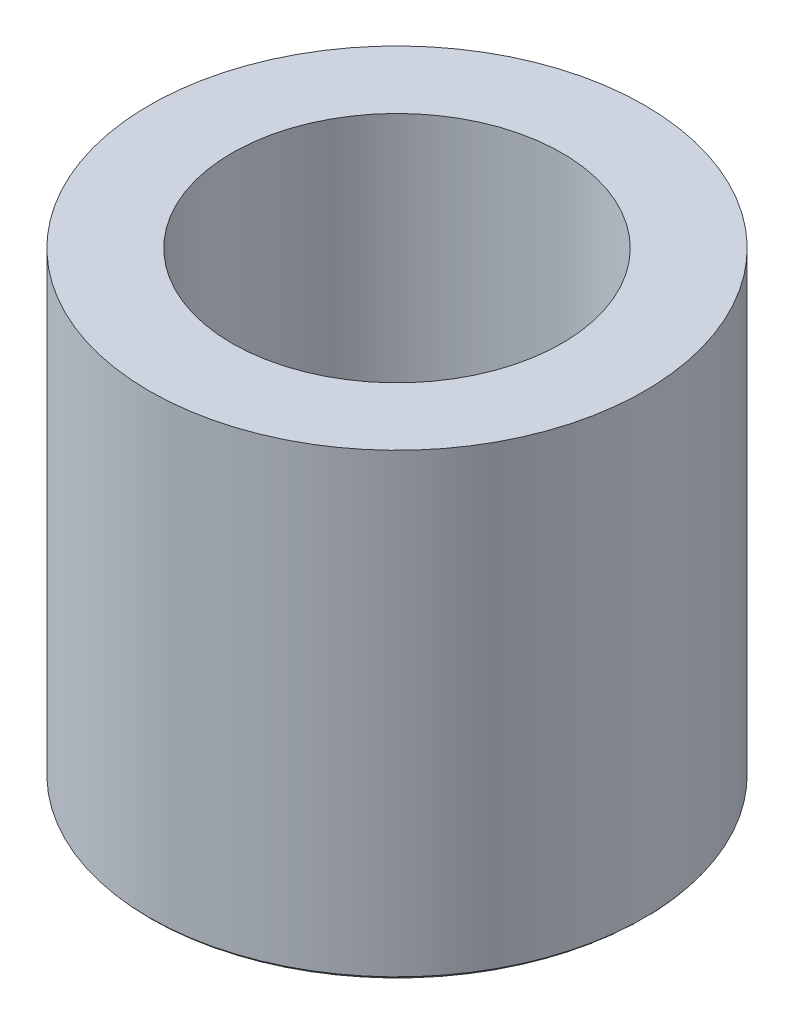
ISO-10303-21;
HEADER;
FILE_DESCRIPTION(('STEP AP214'),'2;1');
FILE_NAME('part.step','',(''),(''),'','','');
FILE_SCHEMA(('AUTOMOTIVE_DESIGN { 1 0 10303 214 1 1 1 1 }'));
ENDSEC;
DATA;
#1=APPLICATION_CONTEXT('core data for automotive mechanical design processes');
#2=APPLICATION_PROTOCOL_DEFINITION('international standard','automotive_design',2000,#1);
#3=PRODUCT_CONTEXT('',#1,'mechanical');
#4=PRODUCT('Part','Part','',(#3));
#5=PRODUCT_RELATED_PRODUCT_CATEGORY('part','',(#4));
#6=PRODUCT_DEFINITION_FORMATION('','',#4);
#7=PRODUCT_DEFINITION_CONTEXT('part definition',#1,'design');
#8=PRODUCT_DEFINITION('design','',#6,#7);
#9=PRODUCT_DEFINITION_SHAPE('','',#8);
#10=(LENGTH_UNIT() NAMED_UNIT(*) SI_UNIT(.MILLI.,.METRE.));
#11=(NAMED_UNIT(*) PLANE_ANGLE_UNIT() SI_UNIT($,.RADIAN.));
#12=(NAMED_UNIT(*) SI_UNIT($,.STERADIAN.) SOLID_ANGLE_UNIT());
#13=UNCERTAINTY_MEASURE_WITH_UNIT(LENGTH_MEASURE(1.E-05),#10,'distance_accuracy_value','');
#14=(GEOMETRIC_REPRESENTATION_CONTEXT(3) GLOBAL_UNCERTAINTY_ASSIGNED_CONTEXT((#13)) GLOBAL_UNIT_ASSIGNED_CONTEXT((#10,
#11,#12)) REPRESENTATION_CONTEXT('',''));
#15=CARTESIAN_POINT('',(0.,0.,0.));
#16=DIRECTION('',(0.,0.,1.));
#17=DIRECTION('',(1.,0.,0.));
#18=AXIS2_PLACEMENT_3D('',#15,#16,#17);
#19=CARTESIAN_POINT('',(0.,-10.8826497308104,0.));
#20=DIRECTION('',(0.,1.,0.));
#21=DIRECTION('',(0.,0.,1.));
#22=AXIS2_PLACEMENT_3D('',#19,#20,#21);
#23=TOROIDAL_SURFACE('',#22,13.58,1.);
#24=CARTESIAN_POINT('',(0.,-11.7486751345948,0.));
#25=DIRECTION('',(0.,1.,0.));
#26=DIRECTION('',(0.,0.,1.));
#27=AXIS2_PLACEMENT_3D('',#24,#25,#26);
#28=CIRCLE('',#27,14.08);
#29=CARTESIAN_POINT('',(0.,-11.7486751345948,14.08));
#30=VERTEX_POINT('',#29);
#31=EDGE_CURVE('E10',#30,#30,#28,.T.);
#32=ORIENTED_EDGE('',*,*,#31,.T.);
#33=EDGE_LOOP('',(#32));
#34=FACE_BOUND('',#33,.T.);
#35=CARTESIAN_POINT('',(0.,-11.4826497308104,0.));
#36=DIRECTION('',(0.,1.,0.));
#37=DIRECTION('',(0.,0.,1.));
#38=AXIS2_PLACEMENT_3D('',#35,#36,#37);
#39=CIRCLE('',#38,14.38);
#40=CARTESIAN_POINT('',(0.,-11.4826497308104,14.38));
#41=VERTEX_POINT('',#40);
#42=EDGE_CURVE('E60',#41,#41,#39,.T.);
#43=ORIENTED_EDGE('',*,*,#42,.F.);
#44=EDGE_LOOP('',(#43));
#45=FACE_BOUND('',#44,.T.);
#46=ADVANCED_FACE('F41',(#34,#45),#23,.T.);
#47=CARTESIAN_POINT('',(0.,15.,0.));
#48=DIRECTION('',(0.,1.,0.));
#49=DIRECTION('',(0.,0.,1.));
#50=AXIS2_PLACEMENT_3D('',#47,#48,#49);
#51=PLANE('',#50);
#52=CARTESIAN_POINT('',(0.,15.,0.));
#53=DIRECTION('',(0.,1.,0.));
#54=DIRECTION('',(0.,0.,1.));
#55=AXIS2_PLACEMENT_3D('',#52,#53,#54);
#56=CIRCLE('',#55,9.58);
#57=CARTESIAN_POINT('',(0.,15.,9.58));
#58=VERTEX_POINT('',#57);
#59=EDGE_CURVE('E55',#58,#58,#56,.T.);
#60=ORIENTED_EDGE('',*,*,#59,.F.);
#61=EDGE_LOOP('',(#60));
#62=FACE_BOUND('',#61,.T.);
#63=CARTESIAN_POINT('',(0.,15.,0.));
#64=DIRECTION('',(0.,1.,0.));
#65=DIRECTION('',(0.,0.,1.));
#66=AXIS2_PLACEMENT_3D('',#63,#64,#65);
#67=CIRCLE('',#66,14.38);
#68=CARTESIAN_POINT('',(0.,15.,14.38));
#69=VERTEX_POINT('',#68);
#70=EDGE_CURVE('E63',#69,#69,#67,.T.);
#71=ORIENTED_EDGE('',*,*,#70,.T.);
#72=EDGE_LOOP('',(#71));
#73=FACE_BOUND('',#72,.T.);
#74=ADVANCED_FACE('F67',(#62,#73),#51,.T.);
#75=CARTESIAN_POINT('',(0.,-13.4807259421637,0.));
#76=DIRECTION('',(0.,1.,0.));
#77=DIRECTION('',(0.,0.,1.));
#78=AXIS2_PLACEMENT_3D('',#75,#76,#77);
#79=CONICAL_SURFACE('',#78,11.08,1.0471975511966);
#80=ORIENTED_EDGE('',*,*,#31,.F.);
#81=EDGE_LOOP('',(#80));
#82=FACE_BOUND('',#81,.T.);
#83=CARTESIAN_POINT('',(0.,-13.4807259421637,0.));
#84=DIRECTION('',(0.,1.,0.));
#85=DIRECTION('',(0.,0.,1.));
#86=AXIS2_PLACEMENT_3D('',#83,#84,#85);
#87=CIRCLE('',#86,11.08);
#88=CARTESIAN_POINT('',(0.,-13.4807259421637,11.08));
#89=VERTEX_POINT('',#88);
#90=EDGE_CURVE('E47',#89,#89,#87,.T.);
#91=ORIENTED_EDGE('',*,*,#90,.T.);
#92=EDGE_LOOP('',(#91));
#93=FACE_BOUND('',#92,.T.);
#94=ADVANCED_FACE('F80',(#82,#93),#79,.T.);
#95=CARTESIAN_POINT('',(0.,-12.6147005383793,0.));
#96=DIRECTION('',(0.,1.,0.));
#97=DIRECTION('',(0.,0.,1.));
#98=AXIS2_PLACEMENT_3D('',#95,#96,#97);
#99=TOROIDAL_SURFACE('',#98,10.58,1.);
#100=ORIENTED_EDGE('',*,*,#90,.F.);
#101=EDGE_LOOP('',(#100));
#102=FACE_BOUND('',#101,.T.);
#103=CARTESIAN_POINT('',(0.,-12.6147005383792,0.));
#104=DIRECTION('',(0.,1.,0.));
#105=DIRECTION('',(0.,0.,1.));
#106=AXIS2_PLACEMENT_3D('',#103,#104,#105);
#107=CIRCLE('',#106,9.58);
#108=CARTESIAN_POINT('',(0.,-12.6147005383792,9.58));
#109=VERTEX_POINT('',#108);
#110=EDGE_CURVE('E51',#109,#109,#107,.T.);
#111=ORIENTED_EDGE('',*,*,#110,.T.);
#112=EDGE_LOOP('',(#111));
#113=FACE_BOUND('',#112,.T.);
#114=ADVANCED_FACE('F86',(#102,#113),#99,.T.);
#115=CARTESIAN_POINT('',(0.,0.,0.));
#116=DIRECTION('',(0.,1.,0.));
#117=DIRECTION('',(0.,0.,1.));
#118=AXIS2_PLACEMENT_3D('',#115,#116,#117);
#119=CYLINDRICAL_SURFACE('',#118,9.58);
#120=ORIENTED_EDGE('',*,*,#110,.F.);
#121=EDGE_LOOP('',(#120));
#122=FACE_BOUND('',#121,.T.);
#123=ORIENTED_EDGE('',*,*,#59,.T.);
#124=EDGE_LOOP('',(#123));
#125=FACE_BOUND('',#124,.T.);
#126=ADVANCED_FACE('F72',(#122,#125),#119,.F.);
#127=CARTESIAN_POINT('',(0.,-16.,0.));
#128=DIRECTION('',(0.,1.,0.));
#129=DIRECTION('',(0.,0.,1.));
#130=AXIS2_PLACEMENT_3D('',#127,#128,#129);
#131=CYLINDRICAL_SURFACE('',#130,14.38);
#132=ORIENTED_EDGE('',*,*,#70,.F.);
#133=EDGE_LOOP('',(#132));
#134=FACE_BOUND('',#133,.T.);
#135=ORIENTED_EDGE('',*,*,#42,.T.);
#136=EDGE_LOOP('',(#135));
#137=FACE_BOUND('',#136,.T.);
#138=ADVANCED_FACE('F69',(#134,#137),#131,.T.);
#139=CLOSED_SHELL('',(#46,#74,#94,#114,#126,#138));
#140=MANIFOLD_SOLID_BREP('B2',#139);
#141=ADVANCED_BREP_SHAPE_REPRESENTATION('',(#18,#140),#14);
#142=SHAPE_DEFINITION_REPRESENTATION(#9,#141);
ENDSEC;
END-ISO-10303-21;
